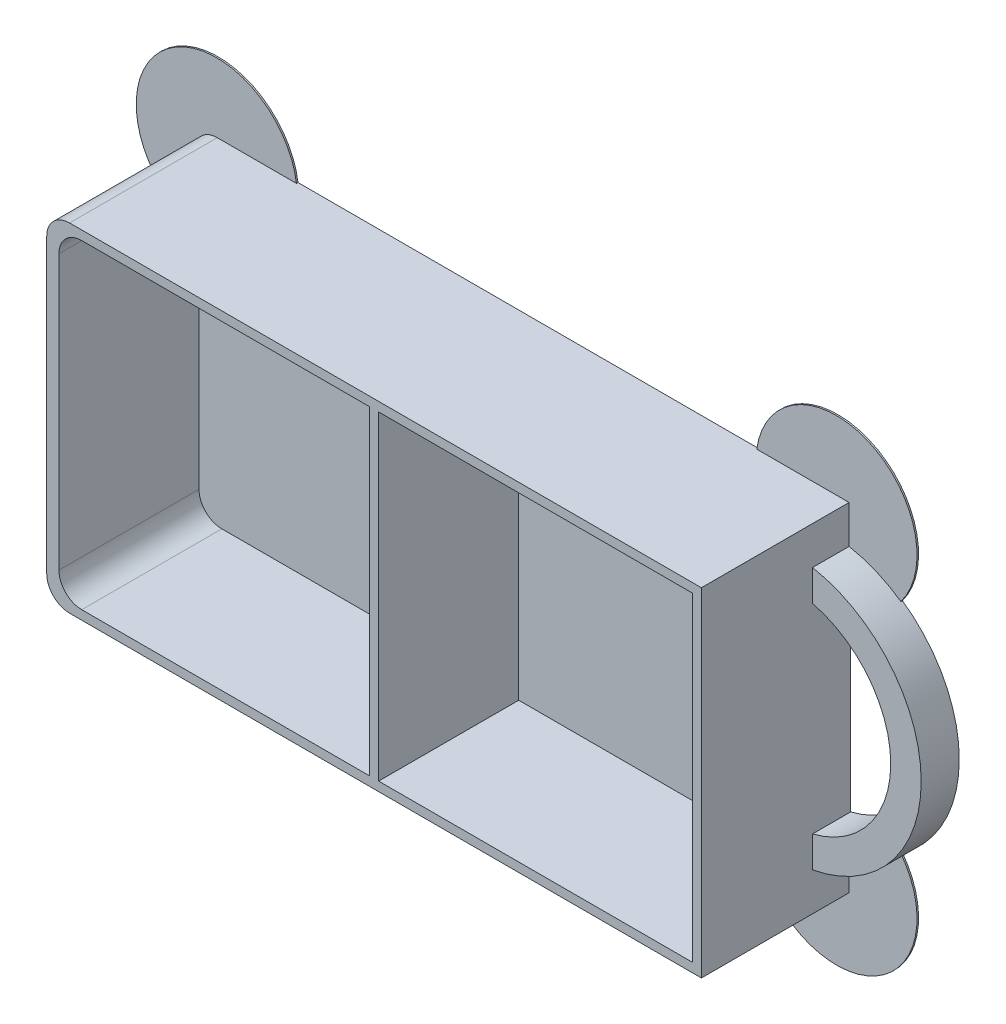
ISO-10303-21;
HEADER;
FILE_DESCRIPTION(('STEP AP214'),'2;1');
FILE_NAME('part.step','',(''),(''),'','','');
FILE_SCHEMA(('AUTOMOTIVE_DESIGN { 1 0 10303 214 1 1 1 1 }'));
ENDSEC;
DATA;
#1=APPLICATION_CONTEXT('core data for automotive mechanical design processes');
#2=APPLICATION_PROTOCOL_DEFINITION('international standard','automotive_design',2000,#1);
#3=PRODUCT_CONTEXT('',#1,'mechanical');
#4=PRODUCT('Part','Part','',(#3));
#5=PRODUCT_RELATED_PRODUCT_CATEGORY('part','',(#4));
#6=PRODUCT_DEFINITION_FORMATION('','',#4);
#7=PRODUCT_DEFINITION_CONTEXT('part definition',#1,'design');
#8=PRODUCT_DEFINITION('design','',#6,#7);
#9=PRODUCT_DEFINITION_SHAPE('','',#8);
#10=(LENGTH_UNIT() NAMED_UNIT(*) SI_UNIT(.MILLI.,.METRE.));
#11=(NAMED_UNIT(*) PLANE_ANGLE_UNIT() SI_UNIT($,.RADIAN.));
#12=(NAMED_UNIT(*) SI_UNIT($,.STERADIAN.) SOLID_ANGLE_UNIT());
#13=UNCERTAINTY_MEASURE_WITH_UNIT(LENGTH_MEASURE(1.E-05),#10,'distance_accuracy_value','');
#14=(GEOMETRIC_REPRESENTATION_CONTEXT(3) GLOBAL_UNCERTAINTY_ASSIGNED_CONTEXT((#13)) GLOBAL_UNIT_ASSIGNED_CONTEXT((#10,
#11,#12)) REPRESENTATION_CONTEXT('',''));
#15=CARTESIAN_POINT('',(0.,0.,0.));
#16=DIRECTION('',(0.,0.,1.));
#17=DIRECTION('',(1.,0.,0.));
#18=AXIS2_PLACEMENT_3D('',#15,#16,#17);
#19=CARTESIAN_POINT('',(-40.,-19.2,19.6));
#20=DIRECTION('',(0.,0.,-1.));
#21=DIRECTION('',(-1.,0.,0.));
#22=AXIS2_PLACEMENT_3D('',#19,#20,#21);
#23=CYLINDRICAL_SURFACE('',#22,3.);
#24=DIRECTION('',(0.,0.,-1.));
#25=VECTOR('',#24,1.);
#26=CARTESIAN_POINT('',(-43.,-19.2,19.6));
#27=LINE('',#26,#25);
#28=CARTESIAN_POINT('',(-43.,-19.2,0.199999999999999));
#29=VERTEX_POINT('',#28);
#30=CARTESIAN_POINT('',(-43.,-19.2,19.6));
#31=VERTEX_POINT('',#30);
#32=EDGE_CURVE('E409',#29,#31,#27,.F.);
#33=ORIENTED_EDGE('',*,*,#32,.F.);
#34=CARTESIAN_POINT('',(-40.,-19.2,0.199999999999999));
#35=DIRECTION('',(0.,0.,-1.));
#36=DIRECTION('',(-1.,0.,0.));
#37=AXIS2_PLACEMENT_3D('',#34,#35,#36);
#38=CIRCLE('',#37,3.);
#39=CARTESIAN_POINT('',(-40.,-22.2,0.199999999999999));
#40=VERTEX_POINT('',#39);
#41=EDGE_CURVE('E49',#29,#40,#38,.F.);
#42=ORIENTED_EDGE('',*,*,#41,.T.);
#43=DIRECTION('',(0.,0.,-1.));
#44=VECTOR('',#43,1.);
#45=CARTESIAN_POINT('',(-40.,-22.2,19.6));
#46=LINE('',#45,#44);
#47=CARTESIAN_POINT('',(-40.,-22.2,19.6));
#48=VERTEX_POINT('',#47);
#49=EDGE_CURVE('E420',#48,#40,#46,.T.);
#50=ORIENTED_EDGE('',*,*,#49,.F.);
#51=CARTESIAN_POINT('',(-40.,-19.2,19.6));
#52=DIRECTION('',(0.,0.,1.));
#53=DIRECTION('',(1.,0.,0.));
#54=AXIS2_PLACEMENT_3D('',#51,#52,#53);
#55=CIRCLE('',#54,3.);
#56=EDGE_CURVE('E416',#31,#48,#55,.T.);
#57=ORIENTED_EDGE('',*,*,#56,.F.);
#58=EDGE_LOOP('',(#33,#42,#50,#57));
#59=FACE_BOUND('',#58,.T.);
#60=ADVANCED_FACE('F41',(#59),#23,.T.);
#61=CARTESIAN_POINT('',(43.,22.2,19.6));
#62=DIRECTION('',(-1.,0.,0.));
#63=DIRECTION('',(0.,-1.,0.));
#64=AXIS2_PLACEMENT_3D('',#61,#62,#63);
#65=PLANE('',#64);
#66=DIRECTION('',(0.,0.,-1.));
#67=VECTOR('',#66,1.);
#68=CARTESIAN_POINT('',(43.,-22.2,19.6));
#69=LINE('',#68,#67);
#70=CARTESIAN_POINT('',(43.,-22.2,19.6));
#71=VERTEX_POINT('',#70);
#72=CARTESIAN_POINT('',(43.,-22.2,0.199999999999999));
#73=VERTEX_POINT('',#72);
#74=EDGE_CURVE('E396',#71,#73,#69,.T.);
#75=ORIENTED_EDGE('',*,*,#74,.T.);
#76=DIRECTION('',(0.,1.,0.));
#77=VECTOR('',#76,1.);
#78=CARTESIAN_POINT('',(43.,22.2,0.199999999999999));
#79=LINE('',#78,#77);
#80=CARTESIAN_POINT('',(43.,-17.2,0.2));
#81=VERTEX_POINT('',#80);
#82=EDGE_CURVE('E249',#73,#81,#79,.T.);
#83=ORIENTED_EDGE('',*,*,#82,.T.);
#84=DIRECTION('',(0.,0.,-1.));
#85=VECTOR('',#84,1.);
#86=CARTESIAN_POINT('',(43.,-17.2,5.));
#87=LINE('',#86,#85);
#88=CARTESIAN_POINT('',(43.,-17.2,5.));
#89=VERTEX_POINT('',#88);
#90=EDGE_CURVE('E369',#89,#81,#87,.T.);
#91=ORIENTED_EDGE('',*,*,#90,.F.);
#92=DIRECTION('',(0.,-1.,0.));
#93=VECTOR('',#92,1.);
#94=CARTESIAN_POINT('',(43.,-17.2,5.));
#95=LINE('',#94,#93);
#96=CARTESIAN_POINT('',(43.,-13.1087756865391,5.));
#97=VERTEX_POINT('',#96);
#98=EDGE_CURVE('E367',#97,#89,#95,.T.);
#99=ORIENTED_EDGE('',*,*,#98,.F.);
#100=DIRECTION('',(0.,0.,-1.));
#101=VECTOR('',#100,1.);
#102=CARTESIAN_POINT('',(43.,-13.1087756865391,5.));
#103=LINE('',#102,#101);
#104=CARTESIAN_POINT('',(43.,-13.1087756865391,0.));
#105=VERTEX_POINT('',#104);
#106=EDGE_CURVE('E374',#97,#105,#103,.T.);
#107=ORIENTED_EDGE('',*,*,#106,.T.);
#108=DIRECTION('',(0.,1.,0.));
#109=VECTOR('',#108,1.);
#110=CARTESIAN_POINT('',(43.,22.2,0.));
#111=LINE('',#110,#109);
#112=CARTESIAN_POINT('',(43.,13.1087756865391,0.));
#113=VERTEX_POINT('',#112);
#114=EDGE_CURVE('E383',#105,#113,#111,.T.);
#115=ORIENTED_EDGE('',*,*,#114,.T.);
#116=DIRECTION('',(0.,0.,-1.));
#117=VECTOR('',#116,1.);
#118=CARTESIAN_POINT('',(43.,13.1087756865391,5.));
#119=LINE('',#118,#117);
#120=CARTESIAN_POINT('',(43.,13.1087756865391,5.));
#121=VERTEX_POINT('',#120);
#122=EDGE_CURVE('E377',#121,#113,#119,.T.);
#123=ORIENTED_EDGE('',*,*,#122,.F.);
#124=DIRECTION('',(0.,-1.,0.));
#125=VECTOR('',#124,1.);
#126=CARTESIAN_POINT('',(43.,17.2,5.));
#127=LINE('',#126,#125);
#128=CARTESIAN_POINT('',(43.,17.2,5.));
#129=VERTEX_POINT('',#128);
#130=EDGE_CURVE('E361',#129,#121,#127,.T.);
#131=ORIENTED_EDGE('',*,*,#130,.F.);
#132=DIRECTION('',(0.,0.,-1.));
#133=VECTOR('',#132,1.);
#134=CARTESIAN_POINT('',(43.,17.2,5.));
#135=LINE('',#134,#133);
#136=CARTESIAN_POINT('',(43.,17.2,0.2));
#137=VERTEX_POINT('',#136);
#138=EDGE_CURVE('E380',#129,#137,#135,.T.);
#139=ORIENTED_EDGE('',*,*,#138,.T.);
#140=DIRECTION('',(0.,-1.,0.));
#141=VECTOR('',#140,1.);
#142=CARTESIAN_POINT('',(43.,22.2,0.199999999999999));
#143=LINE('',#142,#141);
#144=CARTESIAN_POINT('',(43.,22.2,0.199999999999999));
#145=VERTEX_POINT('',#144);
#146=EDGE_CURVE('E296',#145,#137,#143,.T.);
#147=ORIENTED_EDGE('',*,*,#146,.F.);
#148=DIRECTION('',(0.,0.,-1.));
#149=VECTOR('',#148,1.);
#150=CARTESIAN_POINT('',(43.,22.2,19.6));
#151=LINE('',#150,#149);
#152=CARTESIAN_POINT('',(43.,22.2,19.6));
#153=VERTEX_POINT('',#152);
#154=EDGE_CURVE('E406',#153,#145,#151,.T.);
#155=ORIENTED_EDGE('',*,*,#154,.F.);
#156=DIRECTION('',(0.,1.,0.));
#157=VECTOR('',#156,1.);
#158=CARTESIAN_POINT('',(43.,22.2,19.6));
#159=LINE('',#158,#157);
#160=EDGE_CURVE('E384',#71,#153,#159,.T.);
#161=ORIENTED_EDGE('',*,*,#160,.F.);
#162=EDGE_LOOP('',(#75,#83,#91,#99,#107,#115,#123,#131,#139,#147,#155,#161));
#163=FACE_BOUND('',#162,.T.);
#164=ADVANCED_FACE('F492',(#163),#65,.F.);
#165=CARTESIAN_POINT('',(0.,0.,19.6));
#166=DIRECTION('',(0.,0.,1.));
#167=DIRECTION('',(1.,0.,0.));
#168=AXIS2_PLACEMENT_3D('',#165,#166,#167);
#169=PLANE('',#168);
#170=DIRECTION('',(1.,0.,0.));
#171=VECTOR('',#170,1.);
#172=CARTESIAN_POINT('',(0.,-21.,19.6));
#173=LINE('',#172,#171);
#174=CARTESIAN_POINT('',(-38.4,-21.,19.6));
#175=VERTEX_POINT('',#174);
#176=CARTESIAN_POINT('',(-0.6,-21.,19.6));
#177=VERTEX_POINT('',#176);
#178=EDGE_CURVE('E313',#175,#177,#173,.T.);
#179=ORIENTED_EDGE('',*,*,#178,.F.);
#180=CARTESIAN_POINT('',(-38.4,-18.,19.6));
#181=DIRECTION('',(0.,0.,1.));
#182=DIRECTION('',(1.,0.,0.));
#183=AXIS2_PLACEMENT_3D('',#180,#181,#182);
#184=CIRCLE('',#183,3.);
#185=CARTESIAN_POINT('',(-41.4,-18.,19.6));
#186=VERTEX_POINT('',#185);
#187=EDGE_CURVE('E437',#175,#186,#184,.F.);
#188=ORIENTED_EDGE('',*,*,#187,.T.);
#189=DIRECTION('',(0.,-1.,0.));
#190=VECTOR('',#189,1.);
#191=CARTESIAN_POINT('',(-41.4,0.,19.6));
#192=LINE('',#191,#190);
#193=CARTESIAN_POINT('',(-41.4,18.,19.6));
#194=VERTEX_POINT('',#193);
#195=EDGE_CURVE('E322',#194,#186,#192,.T.);
#196=ORIENTED_EDGE('',*,*,#195,.F.);
#197=CARTESIAN_POINT('',(-38.4,18.,19.6));
#198=DIRECTION('',(0.,0.,1.));
#199=DIRECTION('',(1.,0.,0.));
#200=AXIS2_PLACEMENT_3D('',#197,#198,#199);
#201=CIRCLE('',#200,3.);
#202=CARTESIAN_POINT('',(-38.4,21.,19.6));
#203=VERTEX_POINT('',#202);
#204=EDGE_CURVE('E439',#194,#203,#201,.F.);
#205=ORIENTED_EDGE('',*,*,#204,.T.);
#206=DIRECTION('',(-1.,0.,0.));
#207=VECTOR('',#206,1.);
#208=CARTESIAN_POINT('',(0.,21.,19.6));
#209=LINE('',#208,#207);
#210=CARTESIAN_POINT('',(-0.6,21.,19.6));
#211=VERTEX_POINT('',#210);
#212=EDGE_CURVE('E319',#211,#203,#209,.T.);
#213=ORIENTED_EDGE('',*,*,#212,.F.);
#214=DIRECTION('',(0.,1.,0.));
#215=VECTOR('',#214,1.);
#216=CARTESIAN_POINT('',(-0.6,0.,19.6));
#217=LINE('',#216,#215);
#218=EDGE_CURVE('E315',#177,#211,#217,.T.);
#219=ORIENTED_EDGE('',*,*,#218,.F.);
#220=EDGE_LOOP('',(#179,#188,#196,#205,#213,#219));
#221=FACE_BOUND('',#220,.T.);
#222=DIRECTION('',(-1.,0.,0.));
#223=VECTOR('',#222,1.);
#224=CARTESIAN_POINT('',(-43.,22.2,19.6));
#225=LINE('',#224,#223);
#226=CARTESIAN_POINT('',(-40.,22.2,19.6));
#227=VERTEX_POINT('',#226);
#228=EDGE_CURVE('E387',#153,#227,#225,.T.);
#229=ORIENTED_EDGE('',*,*,#228,.T.);
#230=CARTESIAN_POINT('',(-40.,19.2,19.6));
#231=DIRECTION('',(0.,0.,1.));
#232=DIRECTION('',(1.,0.,0.));
#233=AXIS2_PLACEMENT_3D('',#230,#231,#232);
#234=CIRCLE('',#233,3.);
#235=CARTESIAN_POINT('',(-43.,19.2,19.6));
#236=VERTEX_POINT('',#235);
#237=EDGE_CURVE('E418',#227,#236,#234,.T.);
#238=ORIENTED_EDGE('',*,*,#237,.T.);
#239=DIRECTION('',(0.,-1.,0.));
#240=VECTOR('',#239,1.);
#241=CARTESIAN_POINT('',(-43.,22.2,19.6));
#242=LINE('',#241,#240);
#243=EDGE_CURVE('E391',#236,#31,#242,.T.);
#244=ORIENTED_EDGE('',*,*,#243,.T.);
#245=ORIENTED_EDGE('',*,*,#56,.T.);
#246=DIRECTION('',(1.,0.,0.));
#247=VECTOR('',#246,1.);
#248=CARTESIAN_POINT('',(-43.,-22.2,19.6));
#249=LINE('',#248,#247);
#250=EDGE_CURVE('E394',#48,#71,#249,.T.);
#251=ORIENTED_EDGE('',*,*,#250,.T.);
#252=ORIENTED_EDGE('',*,*,#160,.T.);
#253=EDGE_LOOP('',(#229,#238,#244,#245,#251,#252));
#254=FACE_BOUND('',#253,.T.);
#255=DIRECTION('',(1.,0.,0.));
#256=VECTOR('',#255,1.);
#257=CARTESIAN_POINT('',(0.,-21.,19.6));
#258=LINE('',#257,#256);
#259=CARTESIAN_POINT('',(0.6,-21.,19.6));
#260=VERTEX_POINT('',#259);
#261=CARTESIAN_POINT('',(41.8,-21.,19.6));
#262=VERTEX_POINT('',#261);
#263=EDGE_CURVE('E340',#260,#262,#258,.T.);
#264=ORIENTED_EDGE('',*,*,#263,.F.);
#265=DIRECTION('',(0.,1.,0.));
#266=VECTOR('',#265,1.);
#267=CARTESIAN_POINT('',(0.6,0.,19.6));
#268=LINE('',#267,#266);
#269=CARTESIAN_POINT('',(0.6,21.,19.6));
#270=VERTEX_POINT('',#269);
#271=EDGE_CURVE('E303',#260,#270,#268,.T.);
#272=ORIENTED_EDGE('',*,*,#271,.T.);
#273=DIRECTION('',(-1.,0.,0.));
#274=VECTOR('',#273,1.);
#275=CARTESIAN_POINT('',(0.,21.,19.6));
#276=LINE('',#275,#274);
#277=CARTESIAN_POINT('',(41.8,21.,19.6));
#278=VERTEX_POINT('',#277);
#279=EDGE_CURVE('E346',#278,#270,#276,.T.);
#280=ORIENTED_EDGE('',*,*,#279,.F.);
#281=DIRECTION('',(0.,1.,0.));
#282=VECTOR('',#281,1.);
#283=CARTESIAN_POINT('',(41.8,0.,19.6));
#284=LINE('',#283,#282);
#285=EDGE_CURVE('E343',#262,#278,#284,.T.);
#286=ORIENTED_EDGE('',*,*,#285,.F.);
#287=EDGE_LOOP('',(#264,#272,#280,#286));
#288=FACE_BOUND('',#287,.T.);
#289=ADVANCED_FACE('F457',(#221,#254,#288),#169,.T.);
#290=CARTESIAN_POINT('',(-43.,22.2,19.6));
#291=DIRECTION('',(0.,-1.,0.));
#292=DIRECTION('',(0.,0.,-1.));
#293=AXIS2_PLACEMENT_3D('',#290,#291,#292);
#294=PLANE('',#293);
#295=DIRECTION('',(-1.,0.,0.));
#296=VECTOR('',#295,1.);
#297=CARTESIAN_POINT('',(-43.,22.2,0.));
#298=LINE('',#297,#296);
#299=CARTESIAN_POINT('',(30.8693173878087,22.2,0.));
#300=VERTEX_POINT('',#299);
#301=CARTESIAN_POINT('',(-29.5890069113216,22.2,0.));
#302=VERTEX_POINT('',#301);
#303=EDGE_CURVE('E398',#300,#302,#298,.T.);
#304=ORIENTED_EDGE('',*,*,#303,.T.);
#305=DIRECTION('',(0.,0.,-1.));
#306=VECTOR('',#305,1.);
#307=CARTESIAN_POINT('',(-29.5890069113216,22.2,0.2));
#308=LINE('',#307,#306);
#309=CARTESIAN_POINT('',(-29.5890069113216,22.2,0.2));
#310=VERTEX_POINT('',#309);
#311=EDGE_CURVE('E273',#310,#302,#308,.T.);
#312=ORIENTED_EDGE('',*,*,#311,.F.);
#313=DIRECTION('',(-1.,0.,0.));
#314=VECTOR('',#313,1.);
#315=CARTESIAN_POINT('',(-43.,22.2,0.199999999999999));
#316=LINE('',#315,#314);
#317=CARTESIAN_POINT('',(-40.,22.2,0.199999999999999));
#318=VERTEX_POINT('',#317);
#319=EDGE_CURVE('E286',#310,#318,#316,.T.);
#320=ORIENTED_EDGE('',*,*,#319,.T.);
#321=DIRECTION('',(0.,0.,-1.));
#322=VECTOR('',#321,1.);
#323=CARTESIAN_POINT('',(-40.,22.2,19.6));
#324=LINE('',#323,#322);
#325=EDGE_CURVE('E414',#318,#227,#324,.F.);
#326=ORIENTED_EDGE('',*,*,#325,.T.);
#327=ORIENTED_EDGE('',*,*,#228,.F.);
#328=ORIENTED_EDGE('',*,*,#154,.T.);
#329=DIRECTION('',(1.,0.,0.));
#330=VECTOR('',#329,1.);
#331=CARTESIAN_POINT('',(-43.,22.2,0.199999999999999));
#332=LINE('',#331,#330);
#333=CARTESIAN_POINT('',(30.8693173878089,22.2,0.199999999999999));
#334=VERTEX_POINT('',#333);
#335=EDGE_CURVE('E300',#334,#145,#332,.T.);
#336=ORIENTED_EDGE('',*,*,#335,.F.);
#337=DIRECTION('',(0.,0.,-1.));
#338=VECTOR('',#337,1.);
#339=CARTESIAN_POINT('',(30.8693173878089,22.2,0.2));
#340=LINE('',#339,#338);
#341=EDGE_CURVE('E294',#334,#300,#340,.T.);
#342=ORIENTED_EDGE('',*,*,#341,.T.);
#343=EDGE_LOOP('',(#304,#312,#320,#326,#327,#328,#336,#342));
#344=FACE_BOUND('',#343,.T.);
#345=ADVANCED_FACE('F474',(#344),#294,.F.);
#346=CARTESIAN_POINT('',(-43.,22.2,19.6));
#347=DIRECTION('',(1.,0.,0.));
#348=DIRECTION('',(0.,1.,0.));
#349=AXIS2_PLACEMENT_3D('',#346,#347,#348);
#350=PLANE('',#349);
#351=DIRECTION('',(0.,-1.,0.));
#352=VECTOR('',#351,1.);
#353=CARTESIAN_POINT('',(-43.,22.2,0.));
#354=LINE('',#353,#352);
#355=CARTESIAN_POINT('',(-43.,10.5153460907519,0.));
#356=VERTEX_POINT('',#355);
#357=CARTESIAN_POINT('',(-43.,-10.5153460907519,0.));
#358=VERTEX_POINT('',#357);
#359=EDGE_CURVE('E401',#356,#358,#354,.T.);
#360=ORIENTED_EDGE('',*,*,#359,.T.);
#361=DIRECTION('',(0.,0.,-1.));
#362=VECTOR('',#361,1.);
#363=CARTESIAN_POINT('',(-43.,-10.5153460907519,0.2));
#364=LINE('',#363,#362);
#365=CARTESIAN_POINT('',(-43.,-10.5153460907519,0.2));
#366=VERTEX_POINT('',#365);
#367=EDGE_CURVE('E258',#366,#358,#364,.T.);
#368=ORIENTED_EDGE('',*,*,#367,.F.);
#369=DIRECTION('',(0.,1.,0.));
#370=VECTOR('',#369,1.);
#371=CARTESIAN_POINT('',(-43.,22.2,0.199999999999999));
#372=LINE('',#371,#370);
#373=EDGE_CURVE('E270',#29,#366,#372,.T.);
#374=ORIENTED_EDGE('',*,*,#373,.F.);
#375=ORIENTED_EDGE('',*,*,#32,.T.);
#376=ORIENTED_EDGE('',*,*,#243,.F.);
#377=DIRECTION('',(0.,0.,-1.));
#378=VECTOR('',#377,1.);
#379=CARTESIAN_POINT('',(-43.,19.2,19.6));
#380=LINE('',#379,#378);
#381=CARTESIAN_POINT('',(-43.,19.2,0.199999999999999));
#382=VERTEX_POINT('',#381);
#383=EDGE_CURVE('E411',#236,#382,#380,.T.);
#384=ORIENTED_EDGE('',*,*,#383,.T.);
#385=DIRECTION('',(0.,-1.,0.));
#386=VECTOR('',#385,1.);
#387=CARTESIAN_POINT('',(-43.,22.2,0.199999999999999));
#388=LINE('',#387,#386);
#389=CARTESIAN_POINT('',(-43.,10.5153460907519,0.2));
#390=VERTEX_POINT('',#389);
#391=EDGE_CURVE('E281',#382,#390,#388,.T.);
#392=ORIENTED_EDGE('',*,*,#391,.T.);
#393=DIRECTION('',(0.,0.,-1.));
#394=VECTOR('',#393,1.);
#395=CARTESIAN_POINT('',(-43.,10.5153460907519,0.2));
#396=LINE('',#395,#394);
#397=EDGE_CURVE('E272',#390,#356,#396,.T.);
#398=ORIENTED_EDGE('',*,*,#397,.T.);
#399=EDGE_LOOP('',(#360,#368,#374,#375,#376,#384,#392,#398));
#400=FACE_BOUND('',#399,.T.);
#401=ADVANCED_FACE('F464',(#400),#350,.F.);
#402=CARTESIAN_POINT('',(-43.,-22.2,19.6));
#403=DIRECTION('',(0.,1.,0.));
#404=DIRECTION('',(0.,0.,1.));
#405=AXIS2_PLACEMENT_3D('',#402,#403,#404);
#406=PLANE('',#405);
#407=DIRECTION('',(1.,0.,0.));
#408=VECTOR('',#407,1.);
#409=CARTESIAN_POINT('',(-43.,-22.2,0.));
#410=LINE('',#409,#408);
#411=CARTESIAN_POINT('',(-29.5890069113216,-22.2,0.));
#412=VERTEX_POINT('',#411);
#413=CARTESIAN_POINT('',(30.8693173878087,-22.2,0.));
#414=VERTEX_POINT('',#413);
#415=EDGE_CURVE('E388',#412,#414,#410,.T.);
#416=ORIENTED_EDGE('',*,*,#415,.T.);
#417=DIRECTION('',(0.,0.,-1.));
#418=VECTOR('',#417,1.);
#419=CARTESIAN_POINT('',(30.8693173878089,-22.2,0.2));
#420=LINE('',#419,#418);
#421=CARTESIAN_POINT('',(30.8693173878089,-22.2,0.199999999999999));
#422=VERTEX_POINT('',#421);
#423=EDGE_CURVE('E56',#422,#414,#420,.T.);
#424=ORIENTED_EDGE('',*,*,#423,.F.);
#425=DIRECTION('',(1.,0.,0.));
#426=VECTOR('',#425,1.);
#427=CARTESIAN_POINT('',(-43.,-22.2,0.199999999999999));
#428=LINE('',#427,#426);
#429=EDGE_CURVE('E60',#422,#73,#428,.T.);
#430=ORIENTED_EDGE('',*,*,#429,.T.);
#431=ORIENTED_EDGE('',*,*,#74,.F.);
#432=ORIENTED_EDGE('',*,*,#250,.F.);
#433=ORIENTED_EDGE('',*,*,#49,.T.);
#434=DIRECTION('',(-1.,0.,0.));
#435=VECTOR('',#434,1.);
#436=CARTESIAN_POINT('',(-43.,-22.2,0.199999999999999));
#437=LINE('',#436,#435);
#438=CARTESIAN_POINT('',(-29.5890069113216,-22.2,0.2));
#439=VERTEX_POINT('',#438);
#440=EDGE_CURVE('E266',#439,#40,#437,.T.);
#441=ORIENTED_EDGE('',*,*,#440,.F.);
#442=DIRECTION('',(0.,0.,-1.));
#443=VECTOR('',#442,1.);
#444=CARTESIAN_POINT('',(-29.5890069113216,-22.2,0.2));
#445=LINE('',#444,#443);
#446=EDGE_CURVE('E257',#439,#412,#445,.T.);
#447=ORIENTED_EDGE('',*,*,#446,.T.);
#448=EDGE_LOOP('',(#416,#424,#430,#431,#432,#433,#441,#447));
#449=FACE_BOUND('',#448,.T.);
#450=ADVANCED_FACE('F454',(#449),#406,.F.);
#451=CARTESIAN_POINT('',(0.,0.,0.));
#452=DIRECTION('',(0.,0.,1.));
#453=DIRECTION('',(1.,0.,0.));
#454=AXIS2_PLACEMENT_3D('',#451,#452,#453);
#455=PLANE('',#454);
#456=CARTESIAN_POINT('',(39.7735468390197,0.,0.));
#457=DIRECTION('',(0.,0.,1.));
#458=DIRECTION('',(1.,0.,0.));
#459=AXIS2_PLACEMENT_3D('',#456,#457,#458);
#460=CIRCLE('',#459,17.5);
#461=CARTESIAN_POINT('',(49.8115416706904,-14.3348756450606,0.));
#462=VERTEX_POINT('',#461);
#463=CARTESIAN_POINT('',(49.8115416706904,14.3348756450606,0.));
#464=VERTEX_POINT('',#463);
#465=EDGE_CURVE('E224',#462,#464,#460,.T.);
#466=ORIENTED_EDGE('',*,*,#465,.F.);
#467=CARTESIAN_POINT('',(41.3434569045442,-20.6831109444394,0.));
#468=DIRECTION('',(0.,0.,-1.));
#469=DIRECTION('',(1.,0.,0.));
#470=AXIS2_PLACEMENT_3D('',#467,#468,#469);
#471=CIRCLE('',#470,10.5834092344063);
#472=EDGE_CURVE('E230',#462,#414,#471,.T.);
#473=ORIENTED_EDGE('',*,*,#472,.T.);
#474=ORIENTED_EDGE('',*,*,#415,.F.);
#475=CARTESIAN_POINT('',(-40.063146428057,-20.6831109444394,0.));
#476=DIRECTION('',(0.,0.,-1.));
#477=DIRECTION('',(-1.,0.,0.));
#478=AXIS2_PLACEMENT_3D('',#475,#476,#477);
#479=CIRCLE('',#478,10.5834092344063);
#480=EDGE_CURVE('E263',#412,#358,#479,.T.);
#481=ORIENTED_EDGE('',*,*,#480,.T.);
#482=ORIENTED_EDGE('',*,*,#359,.F.);
#483=CARTESIAN_POINT('',(-40.063146428057,20.6831109444394,0.));
#484=DIRECTION('',(0.,0.,-1.));
#485=DIRECTION('',(1.,0.,0.));
#486=AXIS2_PLACEMENT_3D('',#483,#484,#485);
#487=CIRCLE('',#486,10.5834092344063);
#488=EDGE_CURVE('E278',#356,#302,#487,.T.);
#489=ORIENTED_EDGE('',*,*,#488,.T.);
#490=ORIENTED_EDGE('',*,*,#303,.F.);
#491=CARTESIAN_POINT('',(41.3434569045442,20.6831109444394,0.));
#492=DIRECTION('',(0.,0.,-1.));
#493=DIRECTION('',(-1.,0.,0.));
#494=AXIS2_PLACEMENT_3D('',#491,#492,#493);
#495=CIRCLE('',#494,10.5834092344063);
#496=EDGE_CURVE('E233',#300,#464,#495,.T.);
#497=ORIENTED_EDGE('',*,*,#496,.T.);
#498=EDGE_LOOP('',(#466,#473,#474,#481,#482,#489,#490,#497));
#499=FACE_BOUND('',#498,.T.);
#500=CARTESIAN_POINT('',(39.7735468390197,0.,0.));
#501=DIRECTION('',(0.,0.,-1.));
#502=DIRECTION('',(1.,0.,0.));
#503=AXIS2_PLACEMENT_3D('',#500,#501,#502);
#504=CIRCLE('',#503,13.5);
#505=EDGE_CURVE('E236',#113,#105,#504,.T.);
#506=ORIENTED_EDGE('',*,*,#505,.F.);
#507=ORIENTED_EDGE('',*,*,#114,.F.);
#508=EDGE_LOOP('',(#506,#507));
#509=FACE_BOUND('',#508,.T.);
#510=ADVANCED_FACE('F226',(#499,#509),#455,.F.);
#511=CARTESIAN_POINT('',(39.7735468390197,0.,5.));
#512=DIRECTION('',(0.,0.,-1.));
#513=DIRECTION('',(-1.,0.,0.));
#514=AXIS2_PLACEMENT_3D('',#511,#512,#513);
#515=CYLINDRICAL_SURFACE('',#514,17.5);
#516=CARTESIAN_POINT('',(39.7735468390197,0.,0.2));
#517=DIRECTION('',(0.,0.,1.));
#518=DIRECTION('',(1.,0.,0.));
#519=AXIS2_PLACEMENT_3D('',#516,#517,#518);
#520=CIRCLE('',#519,17.5);
#521=CARTESIAN_POINT('',(49.8115416706904,-14.3348756450606,0.2));
#522=VERTEX_POINT('',#521);
#523=EDGE_CURVE('E12',#81,#522,#520,.T.);
#524=ORIENTED_EDGE('',*,*,#523,.T.);
#525=DIRECTION('',(0.,0.,-1.));
#526=VECTOR('',#525,1.);
#527=CARTESIAN_POINT('',(49.8115416706904,-14.3348756450606,0.2));
#528=LINE('',#527,#526);
#529=EDGE_CURVE('E240',#522,#462,#528,.T.);
#530=ORIENTED_EDGE('',*,*,#529,.T.);
#531=ORIENTED_EDGE('',*,*,#465,.T.);
#532=DIRECTION('',(0.,0.,-1.));
#533=VECTOR('',#532,1.);
#534=CARTESIAN_POINT('',(49.8115416706904,14.3348756450606,0.2));
#535=LINE('',#534,#533);
#536=CARTESIAN_POINT('',(49.8115416706904,14.3348756450606,0.2));
#537=VERTEX_POINT('',#536);
#538=EDGE_CURVE('E292',#537,#464,#535,.T.);
#539=ORIENTED_EDGE('',*,*,#538,.F.);
#540=CARTESIAN_POINT('',(39.7735468390197,0.,0.2));
#541=DIRECTION('',(0.,0.,-1.));
#542=DIRECTION('',(-1.,0.,0.));
#543=AXIS2_PLACEMENT_3D('',#540,#541,#542);
#544=CIRCLE('',#543,17.5);
#545=EDGE_CURVE('E441',#137,#537,#544,.T.);
#546=ORIENTED_EDGE('',*,*,#545,.F.);
#547=ORIENTED_EDGE('',*,*,#138,.F.);
#548=CARTESIAN_POINT('',(39.7735468390197,0.,5.));
#549=DIRECTION('',(0.,0.,1.));
#550=DIRECTION('',(1.,0.,0.));
#551=AXIS2_PLACEMENT_3D('',#548,#549,#550);
#552=CIRCLE('',#551,17.5);
#553=EDGE_CURVE('E358',#89,#129,#552,.T.);
#554=ORIENTED_EDGE('',*,*,#553,.F.);
#555=ORIENTED_EDGE('',*,*,#90,.T.);
#556=EDGE_LOOP('',(#524,#530,#531,#539,#546,#547,#554,#555));
#557=FACE_BOUND('',#556,.T.);
#558=ADVANCED_FACE('F241',(#557),#515,.T.);
#559=CARTESIAN_POINT('',(39.7735468390197,0.,5.));
#560=DIRECTION('',(0.,0.,-1.));
#561=DIRECTION('',(-1.,0.,0.));
#562=AXIS2_PLACEMENT_3D('',#559,#560,#561);
#563=CYLINDRICAL_SURFACE('',#562,13.5);
#564=ORIENTED_EDGE('',*,*,#505,.T.);
#565=ORIENTED_EDGE('',*,*,#106,.F.);
#566=CARTESIAN_POINT('',(39.7735468390197,0.,5.));
#567=DIRECTION('',(0.,0.,-1.));
#568=DIRECTION('',(1.,0.,0.));
#569=AXIS2_PLACEMENT_3D('',#566,#567,#568);
#570=CIRCLE('',#569,13.5);
#571=EDGE_CURVE('E364',#121,#97,#570,.T.);
#572=ORIENTED_EDGE('',*,*,#571,.F.);
#573=ORIENTED_EDGE('',*,*,#122,.T.);
#574=EDGE_LOOP('',(#564,#565,#572,#573));
#575=FACE_BOUND('',#574,.T.);
#576=ADVANCED_FACE('F574',(#575),#563,.F.);
#577=CARTESIAN_POINT('',(39.7735468390197,0.,5.));
#578=DIRECTION('',(0.,0.,1.));
#579=DIRECTION('',(1.,0.,0.));
#580=AXIS2_PLACEMENT_3D('',#577,#578,#579);
#581=PLANE('',#580);
#582=ORIENTED_EDGE('',*,*,#553,.T.);
#583=ORIENTED_EDGE('',*,*,#130,.T.);
#584=ORIENTED_EDGE('',*,*,#571,.T.);
#585=ORIENTED_EDGE('',*,*,#98,.T.);
#586=EDGE_LOOP('',(#582,#583,#584,#585));
#587=FACE_BOUND('',#586,.T.);
#588=ADVANCED_FACE('F570',(#587),#581,.T.);
#589=CARTESIAN_POINT('',(0.6,0.,-58.8340037733283));
#590=DIRECTION('',(1.,0.,0.));
#591=DIRECTION('',(0.,0.,-1.));
#592=AXIS2_PLACEMENT_3D('',#589,#590,#591);
#593=PLANE('',#592);
#594=DIRECTION('',(0.,0.,1.));
#595=VECTOR('',#594,1.);
#596=CARTESIAN_POINT('',(0.6,21.,-58.8340037733283));
#597=LINE('',#596,#595);
#598=CARTESIAN_POINT('',(0.6,21.,1.2));
#599=VERTEX_POINT('',#598);
#600=EDGE_CURVE('E333',#599,#270,#597,.T.);
#601=ORIENTED_EDGE('',*,*,#600,.T.);
#602=ORIENTED_EDGE('',*,*,#271,.F.);
#603=DIRECTION('',(0.,0.,1.));
#604=VECTOR('',#603,1.);
#605=CARTESIAN_POINT('',(0.6,-21.,-58.8340037733283));
#606=LINE('',#605,#604);
#607=CARTESIAN_POINT('',(0.6,-21.,1.2));
#608=VERTEX_POINT('',#607);
#609=EDGE_CURVE('E349',#608,#260,#606,.T.);
#610=ORIENTED_EDGE('',*,*,#609,.F.);
#611=DIRECTION('',(0.,-1.,0.));
#612=VECTOR('',#611,1.);
#613=CARTESIAN_POINT('',(0.6,0.,1.2));
#614=LINE('',#613,#612);
#615=EDGE_CURVE('E335',#599,#608,#614,.T.);
#616=ORIENTED_EDGE('',*,*,#615,.F.);
#617=EDGE_LOOP('',(#601,#602,#610,#616));
#618=FACE_BOUND('',#617,.T.);
#619=ADVANCED_FACE('F560',(#618),#593,.T.);
#620=CARTESIAN_POINT('',(0.,21.,-58.8340037733283));
#621=DIRECTION('',(0.,1.,0.));
#622=DIRECTION('',(0.,0.,1.));
#623=AXIS2_PLACEMENT_3D('',#620,#621,#622);
#624=PLANE('',#623);
#625=DIRECTION('',(1.,0.,0.));
#626=VECTOR('',#625,1.);
#627=CARTESIAN_POINT('',(0.,21.,1.2));
#628=LINE('',#627,#626);
#629=CARTESIAN_POINT('',(41.8,21.,1.2));
#630=VERTEX_POINT('',#629);
#631=EDGE_CURVE('E332',#599,#630,#628,.T.);
#632=ORIENTED_EDGE('',*,*,#631,.T.);
#633=DIRECTION('',(0.,0.,1.));
#634=VECTOR('',#633,1.);
#635=CARTESIAN_POINT('',(41.8,21.,-58.8340037733283));
#636=LINE('',#635,#634);
#637=EDGE_CURVE('E351',#630,#278,#636,.T.);
#638=ORIENTED_EDGE('',*,*,#637,.T.);
#639=ORIENTED_EDGE('',*,*,#279,.T.);
#640=ORIENTED_EDGE('',*,*,#600,.F.);
#641=EDGE_LOOP('',(#632,#638,#639,#640));
#642=FACE_BOUND('',#641,.T.);
#643=ADVANCED_FACE('F556',(#642),#624,.F.);
#644=CARTESIAN_POINT('',(41.8,0.,-58.8340037733283));
#645=DIRECTION('',(1.,0.,0.));
#646=DIRECTION('',(0.,1.,0.));
#647=AXIS2_PLACEMENT_3D('',#644,#645,#646);
#648=PLANE('',#647);
#649=DIRECTION('',(0.,-1.,0.));
#650=VECTOR('',#649,1.);
#651=CARTESIAN_POINT('',(41.8,0.,1.2));
#652=LINE('',#651,#650);
#653=CARTESIAN_POINT('',(41.8,-21.,1.2));
#654=VERTEX_POINT('',#653);
#655=EDGE_CURVE('E330',#630,#654,#652,.T.);
#656=ORIENTED_EDGE('',*,*,#655,.T.);
#657=DIRECTION('',(0.,0.,1.));
#658=VECTOR('',#657,1.);
#659=CARTESIAN_POINT('',(41.8,-21.,-58.8340037733283));
#660=LINE('',#659,#658);
#661=EDGE_CURVE('E353',#654,#262,#660,.T.);
#662=ORIENTED_EDGE('',*,*,#661,.T.);
#663=ORIENTED_EDGE('',*,*,#285,.T.);
#664=ORIENTED_EDGE('',*,*,#637,.F.);
#665=EDGE_LOOP('',(#656,#662,#663,#664));
#666=FACE_BOUND('',#665,.T.);
#667=ADVANCED_FACE('F559',(#666),#648,.F.);
#668=CARTESIAN_POINT('',(0.,-21.,-58.8340037733283));
#669=DIRECTION('',(0.,-1.,0.));
#670=DIRECTION('',(0.,0.,-1.));
#671=AXIS2_PLACEMENT_3D('',#668,#669,#670);
#672=PLANE('',#671);
#673=DIRECTION('',(-1.,0.,0.));
#674=VECTOR('',#673,1.);
#675=CARTESIAN_POINT('',(0.,-21.,1.2));
#676=LINE('',#675,#674);
#677=EDGE_CURVE('E316',#654,#608,#676,.T.);
#678=ORIENTED_EDGE('',*,*,#677,.T.);
#679=ORIENTED_EDGE('',*,*,#609,.T.);
#680=ORIENTED_EDGE('',*,*,#263,.T.);
#681=ORIENTED_EDGE('',*,*,#661,.F.);
#682=EDGE_LOOP('',(#678,#679,#680,#681));
#683=FACE_BOUND('',#682,.T.);
#684=ADVANCED_FACE('F554',(#683),#672,.F.);
#685=CARTESIAN_POINT('',(0.,0.,1.2));
#686=DIRECTION('',(0.,0.,1.));
#687=DIRECTION('',(1.,0.,0.));
#688=AXIS2_PLACEMENT_3D('',#685,#686,#687);
#689=PLANE('',#688);
#690=ORIENTED_EDGE('',*,*,#631,.F.);
#691=ORIENTED_EDGE('',*,*,#615,.T.);
#692=ORIENTED_EDGE('',*,*,#677,.F.);
#693=ORIENTED_EDGE('',*,*,#655,.F.);
#694=EDGE_LOOP('',(#690,#691,#692,#693));
#695=FACE_BOUND('',#694,.T.);
#696=ADVANCED_FACE('F545',(#695),#689,.T.);
#697=CARTESIAN_POINT('',(0.,-21.,-58.8340037733283));
#698=DIRECTION('',(0.,-1.,0.));
#699=DIRECTION('',(0.,0.,-1.));
#700=AXIS2_PLACEMENT_3D('',#697,#698,#699);
#701=PLANE('',#700);
#702=DIRECTION('',(-1.,0.,0.));
#703=VECTOR('',#702,1.);
#704=CARTESIAN_POINT('',(0.,-21.,1.2));
#705=LINE('',#704,#703);
#706=CARTESIAN_POINT('',(-0.6,-21.,1.2));
#707=VERTEX_POINT('',#706);
#708=CARTESIAN_POINT('',(-38.4,-21.,1.2));
#709=VERTEX_POINT('',#708);
#710=EDGE_CURVE('E310',#707,#709,#705,.T.);
#711=ORIENTED_EDGE('',*,*,#710,.T.);
#712=DIRECTION('',(0.,0.,1.));
#713=VECTOR('',#712,1.);
#714=CARTESIAN_POINT('',(-38.4,-21.,19.6));
#715=LINE('',#714,#713);
#716=EDGE_CURVE('E423',#709,#175,#715,.T.);
#717=ORIENTED_EDGE('',*,*,#716,.T.);
#718=ORIENTED_EDGE('',*,*,#178,.T.);
#719=DIRECTION('',(0.,0.,1.));
#720=VECTOR('',#719,1.);
#721=CARTESIAN_POINT('',(-0.6,-21.,-58.8340037733283));
#722=LINE('',#721,#720);
#723=EDGE_CURVE('E325',#707,#177,#722,.T.);
#724=ORIENTED_EDGE('',*,*,#723,.F.);
#725=EDGE_LOOP('',(#711,#717,#718,#724));
#726=FACE_BOUND('',#725,.T.);
#727=ADVANCED_FACE('F521',(#726),#701,.F.);
#728=CARTESIAN_POINT('',(-41.4,0.,-58.8340037733283));
#729=DIRECTION('',(-1.,0.,0.));
#730=DIRECTION('',(0.,-1.,0.));
#731=AXIS2_PLACEMENT_3D('',#728,#729,#730);
#732=PLANE('',#731);
#733=ORIENTED_EDGE('',*,*,#195,.T.);
#734=DIRECTION('',(0.,0.,1.));
#735=VECTOR('',#734,1.);
#736=CARTESIAN_POINT('',(-41.4,-18.,1.2));
#737=LINE('',#736,#735);
#738=CARTESIAN_POINT('',(-41.4,-18.,1.2));
#739=VERTEX_POINT('',#738);
#740=EDGE_CURVE('E429',#186,#739,#737,.F.);
#741=ORIENTED_EDGE('',*,*,#740,.T.);
#742=DIRECTION('',(0.,1.,0.));
#743=VECTOR('',#742,1.);
#744=CARTESIAN_POINT('',(-41.4,0.,1.2));
#745=LINE('',#744,#743);
#746=CARTESIAN_POINT('',(-41.4,18.,1.2));
#747=VERTEX_POINT('',#746);
#748=EDGE_CURVE('E306',#739,#747,#745,.T.);
#749=ORIENTED_EDGE('',*,*,#748,.T.);
#750=DIRECTION('',(0.,0.,1.));
#751=VECTOR('',#750,1.);
#752=CARTESIAN_POINT('',(-41.4,18.,19.6));
#753=LINE('',#752,#751);
#754=EDGE_CURVE('E426',#747,#194,#753,.T.);
#755=ORIENTED_EDGE('',*,*,#754,.T.);
#756=EDGE_LOOP('',(#733,#741,#749,#755));
#757=FACE_BOUND('',#756,.T.);
#758=ADVANCED_FACE('F537',(#757),#732,.F.);
#759=CARTESIAN_POINT('',(0.,21.,-58.8340037733283));
#760=DIRECTION('',(0.,1.,0.));
#761=DIRECTION('',(0.,0.,1.));
#762=AXIS2_PLACEMENT_3D('',#759,#760,#761);
#763=PLANE('',#762);
#764=ORIENTED_EDGE('',*,*,#212,.T.);
#765=DIRECTION('',(0.,0.,1.));
#766=VECTOR('',#765,1.);
#767=CARTESIAN_POINT('',(-38.4,21.,1.2));
#768=LINE('',#767,#766);
#769=CARTESIAN_POINT('',(-38.4,21.,1.2));
#770=VERTEX_POINT('',#769);
#771=EDGE_CURVE('E435',#203,#770,#768,.F.);
#772=ORIENTED_EDGE('',*,*,#771,.T.);
#773=DIRECTION('',(1.,0.,0.));
#774=VECTOR('',#773,1.);
#775=CARTESIAN_POINT('',(0.,21.,1.2));
#776=LINE('',#775,#774);
#777=CARTESIAN_POINT('',(-0.6,21.,1.2));
#778=VERTEX_POINT('',#777);
#779=EDGE_CURVE('E304',#770,#778,#776,.T.);
#780=ORIENTED_EDGE('',*,*,#779,.T.);
#781=DIRECTION('',(0.,0.,1.));
#782=VECTOR('',#781,1.);
#783=CARTESIAN_POINT('',(-0.6,21.,-58.8340037733283));
#784=LINE('',#783,#782);
#785=EDGE_CURVE('E307',#778,#211,#784,.T.);
#786=ORIENTED_EDGE('',*,*,#785,.T.);
#787=EDGE_LOOP('',(#764,#772,#780,#786));
#788=FACE_BOUND('',#787,.T.);
#789=ADVANCED_FACE('F532',(#788),#763,.F.);
#790=CARTESIAN_POINT('',(-0.6,0.,-58.8340037733283));
#791=DIRECTION('',(1.,0.,0.));
#792=DIRECTION('',(0.,0.,-1.));
#793=AXIS2_PLACEMENT_3D('',#790,#791,#792);
#794=PLANE('',#793);
#795=DIRECTION('',(0.,-1.,0.));
#796=VECTOR('',#795,1.);
#797=CARTESIAN_POINT('',(-0.6,0.,1.2));
#798=LINE('',#797,#796);
#799=EDGE_CURVE('E237',#778,#707,#798,.T.);
#800=ORIENTED_EDGE('',*,*,#799,.T.);
#801=ORIENTED_EDGE('',*,*,#723,.T.);
#802=ORIENTED_EDGE('',*,*,#218,.T.);
#803=ORIENTED_EDGE('',*,*,#785,.F.);
#804=EDGE_LOOP('',(#800,#801,#802,#803));
#805=FACE_BOUND('',#804,.T.);
#806=ADVANCED_FACE('F525',(#805),#794,.F.);
#807=CARTESIAN_POINT('',(0.,0.,1.2));
#808=DIRECTION('',(0.,0.,1.));
#809=DIRECTION('',(1.,0.,0.));
#810=AXIS2_PLACEMENT_3D('',#807,#808,#809);
#811=PLANE('',#810);
#812=ORIENTED_EDGE('',*,*,#748,.F.);
#813=CARTESIAN_POINT('',(-38.4,-18.,1.2));
#814=DIRECTION('',(0.,0.,1.));
#815=DIRECTION('',(1.,0.,0.));
#816=AXIS2_PLACEMENT_3D('',#813,#814,#815);
#817=CIRCLE('',#816,3.);
#818=EDGE_CURVE('E433',#739,#709,#817,.T.);
#819=ORIENTED_EDGE('',*,*,#818,.T.);
#820=ORIENTED_EDGE('',*,*,#710,.F.);
#821=ORIENTED_EDGE('',*,*,#799,.F.);
#822=ORIENTED_EDGE('',*,*,#779,.F.);
#823=CARTESIAN_POINT('',(-38.4,18.,1.2));
#824=DIRECTION('',(0.,0.,1.));
#825=DIRECTION('',(1.,0.,0.));
#826=AXIS2_PLACEMENT_3D('',#823,#824,#825);
#827=CIRCLE('',#826,3.);
#828=EDGE_CURVE('E431',#770,#747,#827,.T.);
#829=ORIENTED_EDGE('',*,*,#828,.T.);
#830=EDGE_LOOP('',(#812,#819,#820,#821,#822,#829));
#831=FACE_BOUND('',#830,.T.);
#832=ADVANCED_FACE('F511',(#831),#811,.T.);
#833=CARTESIAN_POINT('',(-40.,19.2,19.6));
#834=DIRECTION('',(0.,0.,-1.));
#835=DIRECTION('',(-1.,0.,0.));
#836=AXIS2_PLACEMENT_3D('',#833,#834,#835);
#837=CYLINDRICAL_SURFACE('',#836,3.);
#838=CARTESIAN_POINT('',(-40.,19.2,0.199999999999999));
#839=DIRECTION('',(0.,0.,1.));
#840=DIRECTION('',(1.,0.,0.));
#841=AXIS2_PLACEMENT_3D('',#838,#839,#840);
#842=CIRCLE('',#841,3.);
#843=EDGE_CURVE('E444',#382,#318,#842,.F.);
#844=ORIENTED_EDGE('',*,*,#843,.F.);
#845=ORIENTED_EDGE('',*,*,#383,.F.);
#846=ORIENTED_EDGE('',*,*,#237,.F.);
#847=ORIENTED_EDGE('',*,*,#325,.F.);
#848=EDGE_LOOP('',(#844,#845,#846,#847));
#849=FACE_BOUND('',#848,.T.);
#850=ADVANCED_FACE('F467',(#849),#837,.T.);
#851=CARTESIAN_POINT('',(-38.4,-18.,-58.8340037733283));
#852=DIRECTION('',(0.,0.,-1.));
#853=DIRECTION('',(-1.,0.,0.));
#854=AXIS2_PLACEMENT_3D('',#851,#852,#853);
#855=CYLINDRICAL_SURFACE('',#854,3.);
#856=ORIENTED_EDGE('',*,*,#818,.F.);
#857=ORIENTED_EDGE('',*,*,#740,.F.);
#858=ORIENTED_EDGE('',*,*,#187,.F.);
#859=ORIENTED_EDGE('',*,*,#716,.F.);
#860=EDGE_LOOP('',(#856,#857,#858,#859));
#861=FACE_BOUND('',#860,.T.);
#862=ADVANCED_FACE('F501',(#861),#855,.F.);
#863=CARTESIAN_POINT('',(-38.4,18.,-58.8340037733283));
#864=DIRECTION('',(0.,0.,-1.));
#865=DIRECTION('',(-1.,0.,0.));
#866=AXIS2_PLACEMENT_3D('',#863,#864,#865);
#867=CYLINDRICAL_SURFACE('',#866,3.);
#868=ORIENTED_EDGE('',*,*,#828,.F.);
#869=ORIENTED_EDGE('',*,*,#771,.F.);
#870=ORIENTED_EDGE('',*,*,#204,.F.);
#871=ORIENTED_EDGE('',*,*,#754,.F.);
#872=EDGE_LOOP('',(#868,#869,#870,#871));
#873=FACE_BOUND('',#872,.T.);
#874=ADVANCED_FACE('F43',(#873),#867,.F.);
#875=CARTESIAN_POINT('',(41.3434569045442,20.6831109444394,0.2));
#876=DIRECTION('',(0.,0.,-1.));
#877=DIRECTION('',(-1.,0.,0.));
#878=AXIS2_PLACEMENT_3D('',#875,#876,#877);
#879=CYLINDRICAL_SURFACE('',#878,10.5834092344063);
#880=ORIENTED_EDGE('',*,*,#496,.F.);
#881=ORIENTED_EDGE('',*,*,#341,.F.);
#882=CARTESIAN_POINT('',(41.3434569045442,20.6831109444394,0.2));
#883=DIRECTION('',(0.,0.,-1.));
#884=DIRECTION('',(-1.,0.,0.));
#885=AXIS2_PLACEMENT_3D('',#882,#883,#884);
#886=CIRCLE('',#885,10.5834092344063);
#887=EDGE_CURVE('E289',#334,#537,#886,.T.);
#888=ORIENTED_EDGE('',*,*,#887,.T.);
#889=ORIENTED_EDGE('',*,*,#538,.T.);
#890=EDGE_LOOP('',(#880,#881,#888,#889));
#891=FACE_BOUND('',#890,.T.);
#892=ADVANCED_FACE('F508',(#891),#879,.T.);
#893=CARTESIAN_POINT('',(41.3434569045442,20.6831109444394,0.2));
#894=DIRECTION('',(0.,0.,-1.));
#895=DIRECTION('',(-1.,0.,0.));
#896=AXIS2_PLACEMENT_3D('',#893,#894,#895);
#897=PLANE('',#896);
#898=ORIENTED_EDGE('',*,*,#887,.F.);
#899=ORIENTED_EDGE('',*,*,#335,.T.);
#900=ORIENTED_EDGE('',*,*,#146,.T.);
#901=ORIENTED_EDGE('',*,*,#545,.T.);
#902=EDGE_LOOP('',(#898,#899,#900,#901));
#903=FACE_BOUND('',#902,.T.);
#904=ADVANCED_FACE('F625',(#903),#897,.F.);
#905=CARTESIAN_POINT('',(-40.063146428057,20.6831109444394,0.2));
#906=DIRECTION('',(0.,0.,1.));
#907=DIRECTION('',(1.,0.,0.));
#908=AXIS2_PLACEMENT_3D('',#905,#906,#907);
#909=PLANE('',#908);
#910=ORIENTED_EDGE('',*,*,#319,.F.);
#911=CARTESIAN_POINT('',(-40.063146428057,20.6831109444394,0.2));
#912=DIRECTION('',(0.,0.,-1.));
#913=DIRECTION('',(1.,0.,0.));
#914=AXIS2_PLACEMENT_3D('',#911,#912,#913);
#915=CIRCLE('',#914,10.5834092344063);
#916=EDGE_CURVE('E275',#390,#310,#915,.T.);
#917=ORIENTED_EDGE('',*,*,#916,.F.);
#918=ORIENTED_EDGE('',*,*,#391,.F.);
#919=ORIENTED_EDGE('',*,*,#843,.T.);
#920=EDGE_LOOP('',(#910,#917,#918,#919));
#921=FACE_BOUND('',#920,.T.);
#922=ADVANCED_FACE('F470',(#921),#909,.T.);
#923=CARTESIAN_POINT('',(-40.063146428057,20.6831109444394,0.2));
#924=DIRECTION('',(0.,0.,-1.));
#925=DIRECTION('',(-1.,0.,0.));
#926=AXIS2_PLACEMENT_3D('',#923,#924,#925);
#927=CYLINDRICAL_SURFACE('',#926,10.5834092344063);
#928=ORIENTED_EDGE('',*,*,#488,.F.);
#929=ORIENTED_EDGE('',*,*,#397,.F.);
#930=ORIENTED_EDGE('',*,*,#916,.T.);
#931=ORIENTED_EDGE('',*,*,#311,.T.);
#932=EDGE_LOOP('',(#928,#929,#930,#931));
#933=FACE_BOUND('',#932,.T.);
#934=ADVANCED_FACE('F476',(#933),#927,.T.);
#935=CARTESIAN_POINT('',(-40.063146428057,-20.6831109444394,0.2));
#936=DIRECTION('',(0.,0.,-1.));
#937=DIRECTION('',(-1.,0.,0.));
#938=AXIS2_PLACEMENT_3D('',#935,#936,#937);
#939=PLANE('',#938);
#940=ORIENTED_EDGE('',*,*,#41,.F.);
#941=ORIENTED_EDGE('',*,*,#373,.T.);
#942=CARTESIAN_POINT('',(-40.063146428057,-20.6831109444394,0.2));
#943=DIRECTION('',(0.,0.,-1.));
#944=DIRECTION('',(-1.,0.,0.));
#945=AXIS2_PLACEMENT_3D('',#942,#943,#944);
#946=CIRCLE('',#945,10.5834092344063);
#947=EDGE_CURVE('E260',#439,#366,#946,.T.);
#948=ORIENTED_EDGE('',*,*,#947,.F.);
#949=ORIENTED_EDGE('',*,*,#440,.T.);
#950=EDGE_LOOP('',(#940,#941,#948,#949));
#951=FACE_BOUND('',#950,.T.);
#952=ADVANCED_FACE('F482',(#951),#939,.F.);
#953=CARTESIAN_POINT('',(-40.063146428057,-20.6831109444394,0.2));
#954=DIRECTION('',(0.,0.,-1.));
#955=DIRECTION('',(-1.,0.,0.));
#956=AXIS2_PLACEMENT_3D('',#953,#954,#955);
#957=CYLINDRICAL_SURFACE('',#956,10.5834092344063);
#958=ORIENTED_EDGE('',*,*,#480,.F.);
#959=ORIENTED_EDGE('',*,*,#446,.F.);
#960=ORIENTED_EDGE('',*,*,#947,.T.);
#961=ORIENTED_EDGE('',*,*,#367,.T.);
#962=EDGE_LOOP('',(#958,#959,#960,#961));
#963=FACE_BOUND('',#962,.T.);
#964=ADVANCED_FACE('F480',(#963),#957,.T.);
#965=CARTESIAN_POINT('',(41.3434569045442,-20.6831109444394,0.2));
#966=DIRECTION('',(0.,0.,-1.));
#967=DIRECTION('',(-1.,0.,0.));
#968=AXIS2_PLACEMENT_3D('',#965,#966,#967);
#969=CYLINDRICAL_SURFACE('',#968,10.5834092344063);
#970=ORIENTED_EDGE('',*,*,#472,.F.);
#971=ORIENTED_EDGE('',*,*,#529,.F.);
#972=CARTESIAN_POINT('',(41.3434569045442,-20.6831109444394,0.2));
#973=DIRECTION('',(0.,0.,-1.));
#974=DIRECTION('',(1.,0.,0.));
#975=AXIS2_PLACEMENT_3D('',#972,#973,#974);
#976=CIRCLE('',#975,10.5834092344063);
#977=EDGE_CURVE('E250',#522,#422,#976,.T.);
#978=ORIENTED_EDGE('',*,*,#977,.T.);
#979=ORIENTED_EDGE('',*,*,#423,.T.);
#980=EDGE_LOOP('',(#970,#971,#978,#979));
#981=FACE_BOUND('',#980,.T.);
#982=ADVANCED_FACE('F248',(#981),#969,.T.);
#983=CARTESIAN_POINT('',(41.3434569045442,-20.6831109444394,0.2));
#984=DIRECTION('',(0.,0.,1.));
#985=DIRECTION('',(1.,0.,0.));
#986=AXIS2_PLACEMENT_3D('',#983,#984,#985);
#987=PLANE('',#986);
#988=ORIENTED_EDGE('',*,*,#429,.F.);
#989=ORIENTED_EDGE('',*,*,#977,.F.);
#990=ORIENTED_EDGE('',*,*,#523,.F.);
#991=ORIENTED_EDGE('',*,*,#82,.F.);
#992=EDGE_LOOP('',(#988,#989,#990,#991));
#993=FACE_BOUND('',#992,.T.);
#994=ADVANCED_FACE('F673',(#993),#987,.T.);
#995=CLOSED_SHELL('',(#60,#164,#289,#345,#401,#450,#510,#558,#576,#588,#619,#643,#667,#684,#696,
#727,#758,#789,#806,#832,#850,#862,#874,#892,#904,#922,#934,#952,#964,#982,#994));
#996=MANIFOLD_SOLID_BREP('B2',#995);
#997=ADVANCED_BREP_SHAPE_REPRESENTATION('',(#18,#996),#14);
#998=SHAPE_DEFINITION_REPRESENTATION(#9,#997);
ENDSEC;
END-ISO-10303-21;
